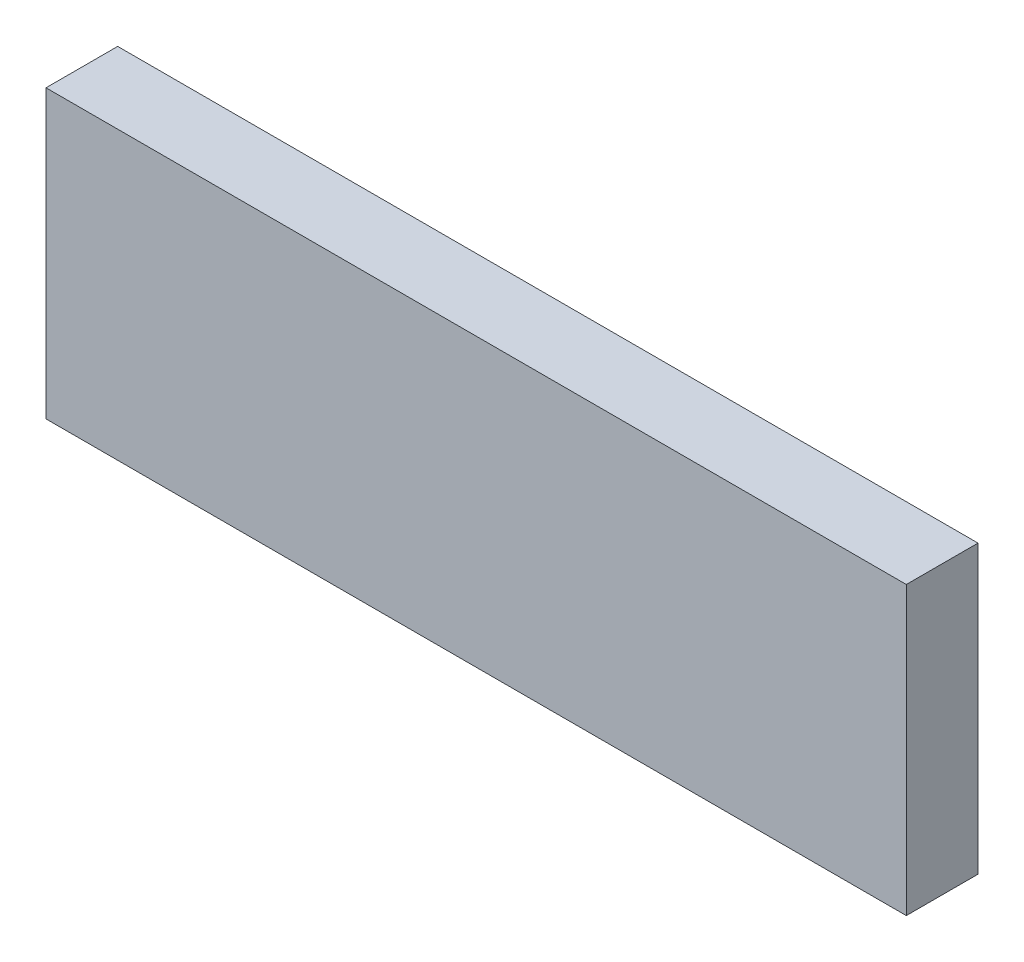
ISO-10303-21;
HEADER;
FILE_DESCRIPTION(('STEP AP214'),'2;1');
FILE_NAME('part.step','',(''),(''),'','','');
FILE_SCHEMA(('AUTOMOTIVE_DESIGN { 1 0 10303 214 1 1 1 1 }'));
ENDSEC;
DATA;
#1=APPLICATION_CONTEXT('core data for automotive mechanical design processes');
#2=APPLICATION_PROTOCOL_DEFINITION('international standard','automotive_design',2000,#1);
#3=PRODUCT_CONTEXT('',#1,'mechanical');
#4=PRODUCT('Part','Part','',(#3));
#5=PRODUCT_RELATED_PRODUCT_CATEGORY('part','',(#4));
#6=PRODUCT_DEFINITION_FORMATION('','',#4);
#7=PRODUCT_DEFINITION_CONTEXT('part definition',#1,'design');
#8=PRODUCT_DEFINITION('design','',#6,#7);
#9=PRODUCT_DEFINITION_SHAPE('','',#8);
#10=(LENGTH_UNIT() NAMED_UNIT(*) SI_UNIT(.MILLI.,.METRE.));
#11=(NAMED_UNIT(*) PLANE_ANGLE_UNIT() SI_UNIT($,.RADIAN.));
#12=(NAMED_UNIT(*) SI_UNIT($,.STERADIAN.) SOLID_ANGLE_UNIT());
#13=UNCERTAINTY_MEASURE_WITH_UNIT(LENGTH_MEASURE(1.E-05),#10,'distance_accuracy_value','');
#14=(GEOMETRIC_REPRESENTATION_CONTEXT(3) GLOBAL_UNCERTAINTY_ASSIGNED_CONTEXT((#13)) GLOBAL_UNIT_ASSIGNED_CONTEXT((#10,
#11,#12)) REPRESENTATION_CONTEXT('',''));
#15=CARTESIAN_POINT('',(0.,0.,0.));
#16=DIRECTION('',(0.,0.,1.));
#17=DIRECTION('',(1.,0.,0.));
#18=AXIS2_PLACEMENT_3D('',#15,#16,#17);
#19=CARTESIAN_POINT('',(60.,-20.,10.));
#20=DIRECTION('',(-1.,0.,0.));
#21=DIRECTION('',(0.,0.,1.));
#22=AXIS2_PLACEMENT_3D('',#19,#20,#21);
#23=PLANE('',#22);
#24=DIRECTION('',(0.,1.,0.));
#25=VECTOR('',#24,1.);
#26=CARTESIAN_POINT('',(60.,-20.,0.));
#27=LINE('',#26,#25);
#28=CARTESIAN_POINT('',(60.,-20.,0.));
#29=VERTEX_POINT('',#28);
#30=CARTESIAN_POINT('',(60.,20.,0.));
#31=VERTEX_POINT('',#30);
#32=EDGE_CURVE('E96',#29,#31,#27,.T.);
#33=ORIENTED_EDGE('',*,*,#32,.T.);
#34=DIRECTION('',(0.,0.,-1.));
#35=VECTOR('',#34,1.);
#36=CARTESIAN_POINT('',(60.,20.,10.));
#37=LINE('',#36,#35);
#38=CARTESIAN_POINT('',(60.,20.,10.));
#39=VERTEX_POINT('',#38);
#40=EDGE_CURVE('E11',#39,#31,#37,.T.);
#41=ORIENTED_EDGE('',*,*,#40,.F.);
#42=DIRECTION('',(0.,1.,0.));
#43=VECTOR('',#42,1.);
#44=CARTESIAN_POINT('',(60.,-20.,10.));
#45=LINE('',#44,#43);
#46=CARTESIAN_POINT('',(60.,-20.,10.));
#47=VERTEX_POINT('',#46);
#48=EDGE_CURVE('E84',#47,#39,#45,.T.);
#49=ORIENTED_EDGE('',*,*,#48,.F.);
#50=DIRECTION('',(0.,0.,-1.));
#51=VECTOR('',#50,1.);
#52=CARTESIAN_POINT('',(60.,-20.,10.));
#53=LINE('',#52,#51);
#54=EDGE_CURVE('E92',#47,#29,#53,.T.);
#55=ORIENTED_EDGE('',*,*,#54,.T.);
#56=EDGE_LOOP('',(#33,#41,#49,#55));
#57=FACE_BOUND('',#56,.T.);
#58=ADVANCED_FACE('F33',(#57),#23,.F.);
#59=CARTESIAN_POINT('',(-60.,20.,10.));
#60=DIRECTION('',(0.,-1.,0.));
#61=DIRECTION('',(0.,0.,-1.));
#62=AXIS2_PLACEMENT_3D('',#59,#60,#61);
#63=PLANE('',#62);
#64=DIRECTION('',(-1.,0.,0.));
#65=VECTOR('',#64,1.);
#66=CARTESIAN_POINT('',(-60.,20.,0.));
#67=LINE('',#66,#65);
#68=CARTESIAN_POINT('',(-60.,20.,0.));
#69=VERTEX_POINT('',#68);
#70=EDGE_CURVE('E88',#31,#69,#67,.T.);
#71=ORIENTED_EDGE('',*,*,#70,.T.);
#72=DIRECTION('',(0.,0.,-1.));
#73=VECTOR('',#72,1.);
#74=CARTESIAN_POINT('',(-60.,20.,10.));
#75=LINE('',#74,#73);
#76=CARTESIAN_POINT('',(-60.,20.,10.));
#77=VERTEX_POINT('',#76);
#78=EDGE_CURVE('E41',#77,#69,#75,.T.);
#79=ORIENTED_EDGE('',*,*,#78,.F.);
#80=DIRECTION('',(-1.,0.,0.));
#81=VECTOR('',#80,1.);
#82=CARTESIAN_POINT('',(-60.,20.,10.));
#83=LINE('',#82,#81);
#84=EDGE_CURVE('E79',#39,#77,#83,.T.);
#85=ORIENTED_EDGE('',*,*,#84,.F.);
#86=ORIENTED_EDGE('',*,*,#40,.T.);
#87=EDGE_LOOP('',(#71,#79,#85,#86));
#88=FACE_BOUND('',#87,.T.);
#89=ADVANCED_FACE('F87',(#88),#63,.F.);
#90=CARTESIAN_POINT('',(-60.,-20.,10.));
#91=DIRECTION('',(1.,0.,0.));
#92=DIRECTION('',(0.,0.,-1.));
#93=AXIS2_PLACEMENT_3D('',#90,#91,#92);
#94=PLANE('',#93);
#95=DIRECTION('',(0.,-1.,0.));
#96=VECTOR('',#95,1.);
#97=CARTESIAN_POINT('',(-60.,-20.,0.));
#98=LINE('',#97,#96);
#99=CARTESIAN_POINT('',(-60.,-20.,0.));
#100=VERTEX_POINT('',#99);
#101=EDGE_CURVE('E66',#69,#100,#98,.T.);
#102=ORIENTED_EDGE('',*,*,#101,.T.);
#103=DIRECTION('',(0.,0.,-1.));
#104=VECTOR('',#103,1.);
#105=CARTESIAN_POINT('',(-60.,-20.,10.));
#106=LINE('',#105,#104);
#107=CARTESIAN_POINT('',(-60.,-20.,10.));
#108=VERTEX_POINT('',#107);
#109=EDGE_CURVE('E89',#108,#100,#106,.T.);
#110=ORIENTED_EDGE('',*,*,#109,.F.);
#111=DIRECTION('',(0.,-1.,0.));
#112=VECTOR('',#111,1.);
#113=CARTESIAN_POINT('',(-60.,-20.,10.));
#114=LINE('',#113,#112);
#115=EDGE_CURVE('E82',#77,#108,#114,.T.);
#116=ORIENTED_EDGE('',*,*,#115,.F.);
#117=ORIENTED_EDGE('',*,*,#78,.T.);
#118=EDGE_LOOP('',(#102,#110,#116,#117));
#119=FACE_BOUND('',#118,.T.);
#120=ADVANCED_FACE('F90',(#119),#94,.F.);
#121=CARTESIAN_POINT('',(-60.,-20.,10.));
#122=DIRECTION('',(0.,1.,0.));
#123=DIRECTION('',(0.,0.,1.));
#124=AXIS2_PLACEMENT_3D('',#121,#122,#123);
#125=PLANE('',#124);
#126=DIRECTION('',(1.,0.,0.));
#127=VECTOR('',#126,1.);
#128=CARTESIAN_POINT('',(-60.,-20.,0.));
#129=LINE('',#128,#127);
#130=EDGE_CURVE('E72',#100,#29,#129,.T.);
#131=ORIENTED_EDGE('',*,*,#130,.T.);
#132=ORIENTED_EDGE('',*,*,#54,.F.);
#133=DIRECTION('',(1.,0.,0.));
#134=VECTOR('',#133,1.);
#135=CARTESIAN_POINT('',(-60.,-20.,10.));
#136=LINE('',#135,#134);
#137=EDGE_CURVE('E49',#108,#47,#136,.T.);
#138=ORIENTED_EDGE('',*,*,#137,.F.);
#139=ORIENTED_EDGE('',*,*,#109,.T.);
#140=EDGE_LOOP('',(#131,#132,#138,#139));
#141=FACE_BOUND('',#140,.T.);
#142=ADVANCED_FACE('F103',(#141),#125,.F.);
#143=CARTESIAN_POINT('',(0.,0.,10.));
#144=DIRECTION('',(0.,0.,-1.));
#145=DIRECTION('',(-1.,0.,0.));
#146=AXIS2_PLACEMENT_3D('',#143,#144,#145);
#147=PLANE('',#146);
#148=ORIENTED_EDGE('',*,*,#48,.T.);
#149=ORIENTED_EDGE('',*,*,#84,.T.);
#150=ORIENTED_EDGE('',*,*,#115,.T.);
#151=ORIENTED_EDGE('',*,*,#137,.T.);
#152=EDGE_LOOP('',(#148,#149,#150,#151));
#153=FACE_BOUND('',#152,.T.);
#154=ADVANCED_FACE('F80',(#153),#147,.F.);
#155=CARTESIAN_POINT('',(0.,0.,0.));
#156=DIRECTION('',(0.,0.,-1.));
#157=DIRECTION('',(-1.,0.,0.));
#158=AXIS2_PLACEMENT_3D('',#155,#156,#157);
#159=PLANE('',#158);
#160=ORIENTED_EDGE('',*,*,#32,.F.);
#161=ORIENTED_EDGE('',*,*,#130,.F.);
#162=ORIENTED_EDGE('',*,*,#101,.F.);
#163=ORIENTED_EDGE('',*,*,#70,.F.);
#164=EDGE_LOOP('',(#160,#161,#162,#163));
#165=FACE_BOUND('',#164,.T.);
#166=ADVANCED_FACE('F106',(#165),#159,.T.);
#167=CLOSED_SHELL('',(#58,#89,#120,#142,#154,#166));
#168=MANIFOLD_SOLID_BREP('B2',#167);
#169=ADVANCED_BREP_SHAPE_REPRESENTATION('',(#18,#168),#14);
#170=SHAPE_DEFINITION_REPRESENTATION(#9,#169);
ENDSEC;
END-ISO-10303-21;
